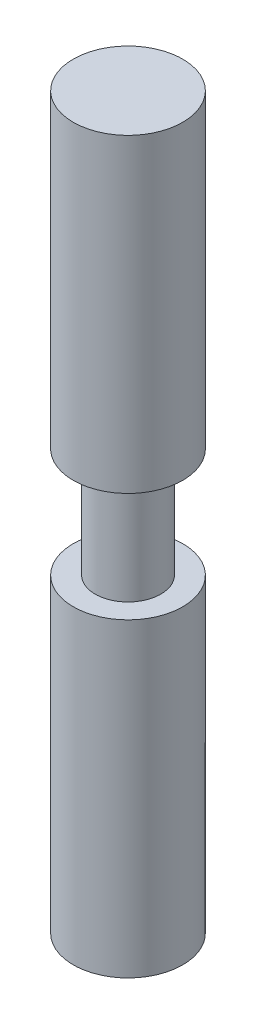
ISO-10303-21;
HEADER;
FILE_DESCRIPTION(('STEP AP214'),'2;1');
FILE_NAME('part.step','',(''),(''),'','','');
FILE_SCHEMA(('AUTOMOTIVE_DESIGN { 1 0 10303 214 1 1 1 1 }'));
ENDSEC;
DATA;
#1=APPLICATION_CONTEXT('core data for automotive mechanical design processes');
#2=APPLICATION_PROTOCOL_DEFINITION('international standard','automotive_design',2000,#1);
#3=PRODUCT_CONTEXT('',#1,'mechanical');
#4=PRODUCT('Part','Part','',(#3));
#5=PRODUCT_RELATED_PRODUCT_CATEGORY('part','',(#4));
#6=PRODUCT_DEFINITION_FORMATION('','',#4);
#7=PRODUCT_DEFINITION_CONTEXT('part definition',#1,'design');
#8=PRODUCT_DEFINITION('design','',#6,#7);
#9=PRODUCT_DEFINITION_SHAPE('','',#8);
#10=(LENGTH_UNIT() NAMED_UNIT(*) SI_UNIT(.MILLI.,.METRE.));
#11=(NAMED_UNIT(*) PLANE_ANGLE_UNIT() SI_UNIT($,.RADIAN.));
#12=(NAMED_UNIT(*) SI_UNIT($,.STERADIAN.) SOLID_ANGLE_UNIT());
#13=UNCERTAINTY_MEASURE_WITH_UNIT(LENGTH_MEASURE(1.E-05),#10,'distance_accuracy_value','');
#14=(GEOMETRIC_REPRESENTATION_CONTEXT(3) GLOBAL_UNCERTAINTY_ASSIGNED_CONTEXT((#13)) GLOBAL_UNIT_ASSIGNED_CONTEXT((#10,
#11,#12)) REPRESENTATION_CONTEXT('',''));
#15=CARTESIAN_POINT('',(0.,0.,0.));
#16=DIRECTION('',(0.,0.,1.));
#17=DIRECTION('',(1.,0.,0.));
#18=AXIS2_PLACEMENT_3D('',#15,#16,#17);
#19=CARTESIAN_POINT('',(0.,19.05,0.));
#20=DIRECTION('',(0.,-1.,0.));
#21=DIRECTION('',(0.,0.,-1.));
#22=AXIS2_PLACEMENT_3D('',#19,#20,#21);
#23=CYLINDRICAL_SURFACE('',#22,5.715);
#24=CARTESIAN_POINT('',(0.,19.05,0.));
#25=DIRECTION('',(0.,1.,0.));
#26=DIRECTION('',(0.,0.,1.));
#27=AXIS2_PLACEMENT_3D('',#24,#25,#26);
#28=CIRCLE('',#27,5.715);
#29=CARTESIAN_POINT('',(0.,19.05,5.715));
#30=VERTEX_POINT('',#29);
#31=EDGE_CURVE('E10',#30,#30,#28,.T.);
#32=ORIENTED_EDGE('',*,*,#31,.F.);
#33=EDGE_LOOP('',(#32));
#34=FACE_BOUND('',#33,.T.);
#35=CARTESIAN_POINT('',(0.,0.,0.));
#36=DIRECTION('',(0.,-1.,0.));
#37=DIRECTION('',(0.,0.,-1.));
#38=AXIS2_PLACEMENT_3D('',#35,#36,#37);
#39=CIRCLE('',#38,5.715);
#40=CARTESIAN_POINT('',(0.,0.,-5.715));
#41=VERTEX_POINT('',#40);
#42=EDGE_CURVE('E53',#41,#41,#39,.T.);
#43=ORIENTED_EDGE('',*,*,#42,.F.);
#44=EDGE_LOOP('',(#43));
#45=FACE_BOUND('',#44,.T.);
#46=ADVANCED_FACE('F34',(#34,#45),#23,.T.);
#47=CARTESIAN_POINT('',(0.,73.025,0.));
#48=DIRECTION('',(0.,-1.,0.));
#49=DIRECTION('',(0.,0.,-1.));
#50=AXIS2_PLACEMENT_3D('',#47,#48,#49);
#51=CYLINDRICAL_SURFACE('',#50,9.525);
#52=CARTESIAN_POINT('',(0.,73.025,0.));
#53=DIRECTION('',(0.,1.,0.));
#54=DIRECTION('',(0.,0.,1.));
#55=AXIS2_PLACEMENT_3D('',#52,#53,#54);
#56=CIRCLE('',#55,9.525);
#57=CARTESIAN_POINT('',(0.,73.025,9.525));
#58=VERTEX_POINT('',#57);
#59=EDGE_CURVE('E41',#58,#58,#56,.T.);
#60=ORIENTED_EDGE('',*,*,#59,.F.);
#61=EDGE_LOOP('',(#60));
#62=FACE_BOUND('',#61,.T.);
#63=CARTESIAN_POINT('',(0.,19.05,0.));
#64=DIRECTION('',(0.,1.,0.));
#65=DIRECTION('',(0.,0.,1.));
#66=AXIS2_PLACEMENT_3D('',#63,#64,#65);
#67=CIRCLE('',#66,9.525);
#68=CARTESIAN_POINT('',(0.,19.05,9.525));
#69=VERTEX_POINT('',#68);
#70=EDGE_CURVE('E48',#69,#69,#67,.T.);
#71=ORIENTED_EDGE('',*,*,#70,.T.);
#72=EDGE_LOOP('',(#71));
#73=FACE_BOUND('',#72,.T.);
#74=ADVANCED_FACE('F84',(#62,#73),#51,.T.);
#75=CARTESIAN_POINT('',(0.,73.025,0.));
#76=DIRECTION('',(0.,1.,0.));
#77=DIRECTION('',(0.,0.,1.));
#78=AXIS2_PLACEMENT_3D('',#75,#76,#77);
#79=PLANE('',#78);
#80=ORIENTED_EDGE('',*,*,#59,.T.);
#81=EDGE_LOOP('',(#80));
#82=FACE_BOUND('',#81,.T.);
#83=ADVANCED_FACE('F89',(#82),#79,.T.);
#84=CARTESIAN_POINT('',(0.,19.05,0.));
#85=DIRECTION('',(0.,1.,0.));
#86=DIRECTION('',(0.,0.,1.));
#87=AXIS2_PLACEMENT_3D('',#84,#85,#86);
#88=PLANE('',#87);
#89=ORIENTED_EDGE('',*,*,#31,.T.);
#90=EDGE_LOOP('',(#89));
#91=FACE_BOUND('',#90,.T.);
#92=ORIENTED_EDGE('',*,*,#70,.F.);
#93=EDGE_LOOP('',(#92));
#94=FACE_BOUND('',#93,.T.);
#95=ADVANCED_FACE('F71',(#91,#94),#88,.F.);
#96=CARTESIAN_POINT('',(0.,-53.975,0.));
#97=DIRECTION('',(0.,1.,0.));
#98=DIRECTION('',(0.,0.,1.));
#99=AXIS2_PLACEMENT_3D('',#96,#97,#98);
#100=CYLINDRICAL_SURFACE('',#99,9.525);
#101=CARTESIAN_POINT('',(0.,-53.975,0.));
#102=DIRECTION('',(0.,-1.,0.));
#103=DIRECTION('',(0.,0.,-1.));
#104=AXIS2_PLACEMENT_3D('',#101,#102,#103);
#105=CIRCLE('',#104,9.525);
#106=CARTESIAN_POINT('',(0.,-53.975,-9.525));
#107=VERTEX_POINT('',#106);
#108=EDGE_CURVE('E58',#107,#107,#105,.T.);
#109=ORIENTED_EDGE('',*,*,#108,.F.);
#110=EDGE_LOOP('',(#109));
#111=FACE_BOUND('',#110,.T.);
#112=CARTESIAN_POINT('',(0.,0.,0.));
#113=DIRECTION('',(0.,-1.,0.));
#114=DIRECTION('',(0.,0.,-1.));
#115=AXIS2_PLACEMENT_3D('',#112,#113,#114);
#116=CIRCLE('',#115,9.525);
#117=CARTESIAN_POINT('',(0.,0.,-9.525));
#118=VERTEX_POINT('',#117);
#119=EDGE_CURVE('E59',#118,#118,#116,.T.);
#120=ORIENTED_EDGE('',*,*,#119,.T.);
#121=EDGE_LOOP('',(#120));
#122=FACE_BOUND('',#121,.T.);
#123=ADVANCED_FACE('F68',(#111,#122),#100,.T.);
#124=CARTESIAN_POINT('',(0.,-53.975,0.));
#125=DIRECTION('',(0.,-1.,0.));
#126=DIRECTION('',(0.,0.,-1.));
#127=AXIS2_PLACEMENT_3D('',#124,#125,#126);
#128=PLANE('',#127);
#129=ORIENTED_EDGE('',*,*,#108,.T.);
#130=EDGE_LOOP('',(#129));
#131=FACE_BOUND('',#130,.T.);
#132=ADVANCED_FACE('F66',(#131),#128,.T.);
#133=CARTESIAN_POINT('',(0.,0.,0.));
#134=DIRECTION('',(0.,-1.,0.));
#135=DIRECTION('',(0.,0.,-1.));
#136=AXIS2_PLACEMENT_3D('',#133,#134,#135);
#137=PLANE('',#136);
#138=ORIENTED_EDGE('',*,*,#42,.T.);
#139=EDGE_LOOP('',(#138));
#140=FACE_BOUND('',#139,.T.);
#141=ORIENTED_EDGE('',*,*,#119,.F.);
#142=EDGE_LOOP('',(#141));
#143=FACE_BOUND('',#142,.T.);
#144=ADVANCED_FACE('F75',(#140,#143),#137,.F.);
#145=CLOSED_SHELL('',(#46,#74,#83,#95,#123,#132,#144));
#146=MANIFOLD_SOLID_BREP('B2',#145);
#147=ADVANCED_BREP_SHAPE_REPRESENTATION('',(#18,#146),#14);
#148=SHAPE_DEFINITION_REPRESENTATION(#9,#147);
ENDSEC;
END-ISO-10303-21;
